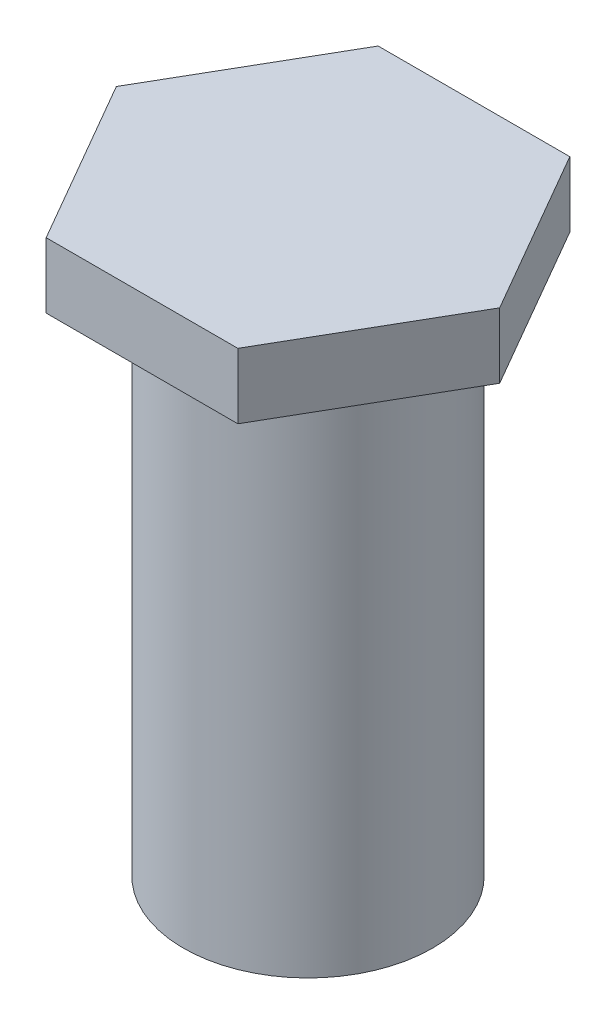
ISO-10303-21;
HEADER;
FILE_DESCRIPTION(('STEP AP214'),'2;1');
FILE_NAME('part.step','',(''),(''),'','','');
FILE_SCHEMA(('AUTOMOTIVE_DESIGN { 1 0 10303 214 1 1 1 1 }'));
ENDSEC;
DATA;
#1=APPLICATION_CONTEXT('core data for automotive mechanical design processes');
#2=APPLICATION_PROTOCOL_DEFINITION('international standard','automotive_design',2000,#1);
#3=PRODUCT_CONTEXT('',#1,'mechanical');
#4=PRODUCT('Part','Part','',(#3));
#5=PRODUCT_RELATED_PRODUCT_CATEGORY('part','',(#4));
#6=PRODUCT_DEFINITION_FORMATION('','',#4);
#7=PRODUCT_DEFINITION_CONTEXT('part definition',#1,'design');
#8=PRODUCT_DEFINITION('design','',#6,#7);
#9=PRODUCT_DEFINITION_SHAPE('','',#8);
#10=(LENGTH_UNIT() NAMED_UNIT(*) SI_UNIT(.MILLI.,.METRE.));
#11=(NAMED_UNIT(*) PLANE_ANGLE_UNIT() SI_UNIT($,.RADIAN.));
#12=(NAMED_UNIT(*) SI_UNIT($,.STERADIAN.) SOLID_ANGLE_UNIT());
#13=UNCERTAINTY_MEASURE_WITH_UNIT(LENGTH_MEASURE(1.E-05),#10,'distance_accuracy_value','');
#14=(GEOMETRIC_REPRESENTATION_CONTEXT(3) GLOBAL_UNCERTAINTY_ASSIGNED_CONTEXT((#13)) GLOBAL_UNIT_ASSIGNED_CONTEXT((#10,
#11,#12)) REPRESENTATION_CONTEXT('',''));
#15=CARTESIAN_POINT('',(0.,0.,0.));
#16=DIRECTION('',(0.,0.,1.));
#17=DIRECTION('',(1.,0.,0.));
#18=AXIS2_PLACEMENT_3D('',#15,#16,#17);
#19=CARTESIAN_POINT('',(0.,0.,0.));
#20=DIRECTION('',(0.,-1.,0.));
#21=DIRECTION('',(1.,0.,0.));
#22=AXIS2_PLACEMENT_3D('',#19,#20,#21);
#23=PLANE('',#22);
#24=CARTESIAN_POINT('',(0.,0.,0.));
#25=DIRECTION('',(0.,-1.,0.));
#26=DIRECTION('',(1.,0.,0.));
#27=AXIS2_PLACEMENT_3D('',#24,#25,#26);
#28=CIRCLE('',#27,4.765);
#29=CARTESIAN_POINT('',(4.765,0.,0.));
#30=VERTEX_POINT('',#29);
#31=EDGE_CURVE('E11',#30,#30,#28,.T.);
#32=ORIENTED_EDGE('',*,*,#31,.T.);
#33=EDGE_LOOP('',(#32));
#34=FACE_BOUND('',#33,.T.);
#35=ADVANCED_FACE('F39',(#34),#23,.T.);
#36=CARTESIAN_POINT('',(0.,0.,0.));
#37=DIRECTION('',(0.,-1.,0.));
#38=DIRECTION('',(1.,0.,0.));
#39=AXIS2_PLACEMENT_3D('',#36,#37,#38);
#40=CYLINDRICAL_SURFACE('',#39,4.765);
#41=CARTESIAN_POINT('',(0.,20.,0.));
#42=DIRECTION('',(0.,-1.,0.));
#43=DIRECTION('',(1.,0.,0.));
#44=AXIS2_PLACEMENT_3D('',#41,#42,#43);
#45=CIRCLE('',#44,4.765);
#46=CARTESIAN_POINT('',(4.76499999999999,20.,0.));
#47=VERTEX_POINT('',#46);
#48=EDGE_CURVE('E48',#47,#47,#45,.T.);
#49=ORIENTED_EDGE('',*,*,#48,.T.);
#50=EDGE_LOOP('',(#49));
#51=FACE_BOUND('',#50,.T.);
#52=ORIENTED_EDGE('',*,*,#31,.F.);
#53=EDGE_LOOP('',(#52));
#54=FACE_BOUND('',#53,.T.);
#55=ADVANCED_FACE('F162',(#51,#54),#40,.T.);
#56=CARTESIAN_POINT('',(-3.66617420935413,22.5,-6.35));
#57=DIRECTION('',(0.866025403784438,0.,0.5));
#58=DIRECTION('',(0.5,0.,-0.866025403784439));
#59=AXIS2_PLACEMENT_3D('',#56,#57,#58);
#60=PLANE('',#59);
#61=DIRECTION('',(-0.5,0.,0.866025403784439));
#62=VECTOR('',#61,1.);
#63=CARTESIAN_POINT('',(-3.66617420935413,20.,-6.35));
#64=LINE('',#63,#62);
#65=CARTESIAN_POINT('',(-3.66617420935413,20.,-6.35));
#66=VERTEX_POINT('',#65);
#67=CARTESIAN_POINT('',(-7.33234841870825,20.,0.));
#68=VERTEX_POINT('',#67);
#69=EDGE_CURVE('E129',#66,#68,#64,.T.);
#70=ORIENTED_EDGE('',*,*,#69,.T.);
#71=DIRECTION('',(0.,-1.,0.));
#72=VECTOR('',#71,1.);
#73=CARTESIAN_POINT('',(-7.33234841870825,22.5,0.));
#74=LINE('',#73,#72);
#75=CARTESIAN_POINT('',(-7.33234841870825,22.5,0.));
#76=VERTEX_POINT('',#75);
#77=EDGE_CURVE('E156',#76,#68,#74,.T.);
#78=ORIENTED_EDGE('',*,*,#77,.F.);
#79=DIRECTION('',(-0.5,0.,0.866025403784439));
#80=VECTOR('',#79,1.);
#81=CARTESIAN_POINT('',(-3.66617420935413,22.5,-6.35));
#82=LINE('',#81,#80);
#83=CARTESIAN_POINT('',(-3.66617420935413,22.5,-6.35));
#84=VERTEX_POINT('',#83);
#85=EDGE_CURVE('E145',#84,#76,#82,.T.);
#86=ORIENTED_EDGE('',*,*,#85,.F.);
#87=DIRECTION('',(0.,-1.,0.));
#88=VECTOR('',#87,1.);
#89=CARTESIAN_POINT('',(-3.66617420935413,22.5,-6.35));
#90=LINE('',#89,#88);
#91=EDGE_CURVE('E125',#84,#66,#90,.T.);
#92=ORIENTED_EDGE('',*,*,#91,.T.);
#93=EDGE_LOOP('',(#70,#78,#86,#92));
#94=FACE_BOUND('',#93,.T.);
#95=ADVANCED_FACE('F173',(#94),#60,.F.);
#96=CARTESIAN_POINT('',(-7.33234841870825,22.5,0.));
#97=DIRECTION('',(0.866025403784439,0.,-0.5));
#98=DIRECTION('',(-0.5,0.,-0.866025403784439));
#99=AXIS2_PLACEMENT_3D('',#96,#97,#98);
#100=PLANE('',#99);
#101=DIRECTION('',(0.5,0.,0.866025403784439));
#102=VECTOR('',#101,1.);
#103=CARTESIAN_POINT('',(-7.33234841870825,20.,0.));
#104=LINE('',#103,#102);
#105=CARTESIAN_POINT('',(-3.66617420935413,20.,6.35));
#106=VERTEX_POINT('',#105);
#107=EDGE_CURVE('E133',#68,#106,#104,.T.);
#108=ORIENTED_EDGE('',*,*,#107,.T.);
#109=DIRECTION('',(0.,-1.,0.));
#110=VECTOR('',#109,1.);
#111=CARTESIAN_POINT('',(-3.66617420935413,22.5,6.35));
#112=LINE('',#111,#110);
#113=CARTESIAN_POINT('',(-3.66617420935413,22.5,6.35));
#114=VERTEX_POINT('',#113);
#115=EDGE_CURVE('E152',#114,#106,#112,.T.);
#116=ORIENTED_EDGE('',*,*,#115,.F.);
#117=DIRECTION('',(0.5,0.,0.866025403784439));
#118=VECTOR('',#117,1.);
#119=CARTESIAN_POINT('',(-7.33234841870825,22.5,0.));
#120=LINE('',#119,#118);
#121=EDGE_CURVE('E94',#76,#114,#120,.T.);
#122=ORIENTED_EDGE('',*,*,#121,.F.);
#123=ORIENTED_EDGE('',*,*,#77,.T.);
#124=EDGE_LOOP('',(#108,#116,#122,#123));
#125=FACE_BOUND('',#124,.T.);
#126=ADVANCED_FACE('F193',(#125),#100,.F.);
#127=CARTESIAN_POINT('',(-3.66617420935413,22.5,6.35));
#128=DIRECTION('',(0.,0.,-1.));
#129=DIRECTION('',(-1.,0.,0.));
#130=AXIS2_PLACEMENT_3D('',#127,#128,#129);
#131=PLANE('',#130);
#132=DIRECTION('',(1.,0.,0.));
#133=VECTOR('',#132,1.);
#134=CARTESIAN_POINT('',(-3.66617420935413,20.,6.35));
#135=LINE('',#134,#133);
#136=CARTESIAN_POINT('',(3.66617420935412,20.,6.35));
#137=VERTEX_POINT('',#136);
#138=EDGE_CURVE('E136',#106,#137,#135,.T.);
#139=ORIENTED_EDGE('',*,*,#138,.T.);
#140=DIRECTION('',(0.,-1.,0.));
#141=VECTOR('',#140,1.);
#142=CARTESIAN_POINT('',(3.66617420935412,22.5,6.35));
#143=LINE('',#142,#141);
#144=CARTESIAN_POINT('',(3.66617420935412,22.5,6.35));
#145=VERTEX_POINT('',#144);
#146=EDGE_CURVE('E118',#145,#137,#143,.T.);
#147=ORIENTED_EDGE('',*,*,#146,.F.);
#148=DIRECTION('',(1.,0.,0.));
#149=VECTOR('',#148,1.);
#150=CARTESIAN_POINT('',(-3.66617420935413,22.5,6.35));
#151=LINE('',#150,#149);
#152=EDGE_CURVE('E107',#114,#145,#151,.T.);
#153=ORIENTED_EDGE('',*,*,#152,.F.);
#154=ORIENTED_EDGE('',*,*,#115,.T.);
#155=EDGE_LOOP('',(#139,#147,#153,#154));
#156=FACE_BOUND('',#155,.T.);
#157=ADVANCED_FACE('F198',(#156),#131,.F.);
#158=CARTESIAN_POINT('',(3.66617420935412,22.5,6.35));
#159=DIRECTION('',(-0.866025403784439,0.,-0.5));
#160=DIRECTION('',(-0.5,0.,0.866025403784439));
#161=AXIS2_PLACEMENT_3D('',#158,#159,#160);
#162=PLANE('',#161);
#163=DIRECTION('',(0.5,0.,-0.866025403784439));
#164=VECTOR('',#163,1.);
#165=CARTESIAN_POINT('',(3.66617420935412,20.,6.35));
#166=LINE('',#165,#164);
#167=CARTESIAN_POINT('',(7.33234841870824,20.,0.));
#168=VERTEX_POINT('',#167);
#169=EDGE_CURVE('E116',#137,#168,#166,.T.);
#170=ORIENTED_EDGE('',*,*,#169,.T.);
#171=DIRECTION('',(0.,-1.,0.));
#172=VECTOR('',#171,1.);
#173=CARTESIAN_POINT('',(7.33234841870824,22.5,0.));
#174=LINE('',#173,#172);
#175=CARTESIAN_POINT('',(7.33234841870824,22.5,0.));
#176=VERTEX_POINT('',#175);
#177=EDGE_CURVE('E113',#176,#168,#174,.T.);
#178=ORIENTED_EDGE('',*,*,#177,.F.);
#179=DIRECTION('',(0.5,0.,-0.866025403784439));
#180=VECTOR('',#179,1.);
#181=CARTESIAN_POINT('',(3.66617420935412,22.5,6.35));
#182=LINE('',#181,#180);
#183=EDGE_CURVE('E101',#145,#176,#182,.T.);
#184=ORIENTED_EDGE('',*,*,#183,.F.);
#185=ORIENTED_EDGE('',*,*,#146,.T.);
#186=EDGE_LOOP('',(#170,#178,#184,#185));
#187=FACE_BOUND('',#186,.T.);
#188=ADVANCED_FACE('F114',(#187),#162,.F.);
#189=CARTESIAN_POINT('',(7.33234841870824,22.5,0.));
#190=DIRECTION('',(-0.866025403784439,0.,0.5));
#191=DIRECTION('',(0.5,0.,0.866025403784439));
#192=AXIS2_PLACEMENT_3D('',#189,#190,#191);
#193=PLANE('',#192);
#194=DIRECTION('',(-0.5,0.,-0.866025403784439));
#195=VECTOR('',#194,1.);
#196=CARTESIAN_POINT('',(7.33234841870824,20.,0.));
#197=LINE('',#196,#195);
#198=CARTESIAN_POINT('',(3.66617420935412,20.,-6.35));
#199=VERTEX_POINT('',#198);
#200=EDGE_CURVE('E79',#168,#199,#197,.T.);
#201=ORIENTED_EDGE('',*,*,#200,.T.);
#202=DIRECTION('',(0.,-1.,0.));
#203=VECTOR('',#202,1.);
#204=CARTESIAN_POINT('',(3.66617420935412,22.5,-6.35));
#205=LINE('',#204,#203);
#206=CARTESIAN_POINT('',(3.66617420935412,22.5,-6.35));
#207=VERTEX_POINT('',#206);
#208=EDGE_CURVE('E119',#207,#199,#205,.T.);
#209=ORIENTED_EDGE('',*,*,#208,.F.);
#210=DIRECTION('',(-0.5,0.,-0.866025403784439));
#211=VECTOR('',#210,1.);
#212=CARTESIAN_POINT('',(7.33234841870824,22.5,0.));
#213=LINE('',#212,#211);
#214=EDGE_CURVE('E105',#176,#207,#213,.T.);
#215=ORIENTED_EDGE('',*,*,#214,.F.);
#216=ORIENTED_EDGE('',*,*,#177,.T.);
#217=EDGE_LOOP('',(#201,#209,#215,#216));
#218=FACE_BOUND('',#217,.T.);
#219=ADVANCED_FACE('F121',(#218),#193,.F.);
#220=CARTESIAN_POINT('',(3.66617420935412,22.5,-6.35));
#221=DIRECTION('',(0.,0.,1.));
#222=DIRECTION('',(1.,0.,0.));
#223=AXIS2_PLACEMENT_3D('',#220,#221,#222);
#224=PLANE('',#223);
#225=DIRECTION('',(-1.,0.,0.));
#226=VECTOR('',#225,1.);
#227=CARTESIAN_POINT('',(3.66617420935412,20.,-6.35));
#228=LINE('',#227,#226);
#229=EDGE_CURVE('E85',#199,#66,#228,.T.);
#230=ORIENTED_EDGE('',*,*,#229,.T.);
#231=ORIENTED_EDGE('',*,*,#91,.F.);
#232=DIRECTION('',(-1.,0.,0.));
#233=VECTOR('',#232,1.);
#234=CARTESIAN_POINT('',(3.66617420935412,22.5,-6.35));
#235=LINE('',#234,#233);
#236=EDGE_CURVE('E56',#207,#84,#235,.T.);
#237=ORIENTED_EDGE('',*,*,#236,.F.);
#238=ORIENTED_EDGE('',*,*,#208,.T.);
#239=EDGE_LOOP('',(#230,#231,#237,#238));
#240=FACE_BOUND('',#239,.T.);
#241=ADVANCED_FACE('F175',(#240),#224,.F.);
#242=CARTESIAN_POINT('',(0.,22.5,0.));
#243=DIRECTION('',(0.,1.,0.));
#244=DIRECTION('',(-1.,0.,0.));
#245=AXIS2_PLACEMENT_3D('',#242,#243,#244);
#246=PLANE('',#245);
#247=ORIENTED_EDGE('',*,*,#85,.T.);
#248=ORIENTED_EDGE('',*,*,#121,.T.);
#249=ORIENTED_EDGE('',*,*,#152,.T.);
#250=ORIENTED_EDGE('',*,*,#183,.T.);
#251=ORIENTED_EDGE('',*,*,#214,.T.);
#252=ORIENTED_EDGE('',*,*,#236,.T.);
#253=EDGE_LOOP('',(#247,#248,#249,#250,#251,#252));
#254=FACE_BOUND('',#253,.T.);
#255=ADVANCED_FACE('F103',(#254),#246,.T.);
#256=CARTESIAN_POINT('',(0.,20.,0.));
#257=DIRECTION('',(0.,1.,0.));
#258=DIRECTION('',(-1.,0.,0.));
#259=AXIS2_PLACEMENT_3D('',#256,#257,#258);
#260=PLANE('',#259);
#261=ORIENTED_EDGE('',*,*,#48,.F.);
#262=EDGE_LOOP('',(#261));
#263=FACE_BOUND('',#262,.T.);
#264=ORIENTED_EDGE('',*,*,#69,.F.);
#265=ORIENTED_EDGE('',*,*,#229,.F.);
#266=ORIENTED_EDGE('',*,*,#200,.F.);
#267=ORIENTED_EDGE('',*,*,#169,.F.);
#268=ORIENTED_EDGE('',*,*,#138,.F.);
#269=ORIENTED_EDGE('',*,*,#107,.F.);
#270=EDGE_LOOP('',(#264,#265,#266,#267,#268,#269));
#271=FACE_BOUND('',#270,.T.);
#272=ADVANCED_FACE('F165',(#263,#271),#260,.F.);
#273=CLOSED_SHELL('',(#35,#55,#95,#126,#157,#188,#219,#241,#255,#272));
#274=MANIFOLD_SOLID_BREP('B2',#273);
#275=ADVANCED_BREP_SHAPE_REPRESENTATION('',(#18,#274),#14);
#276=SHAPE_DEFINITION_REPRESENTATION(#9,#275);
ENDSEC;
END-ISO-10303-21;
